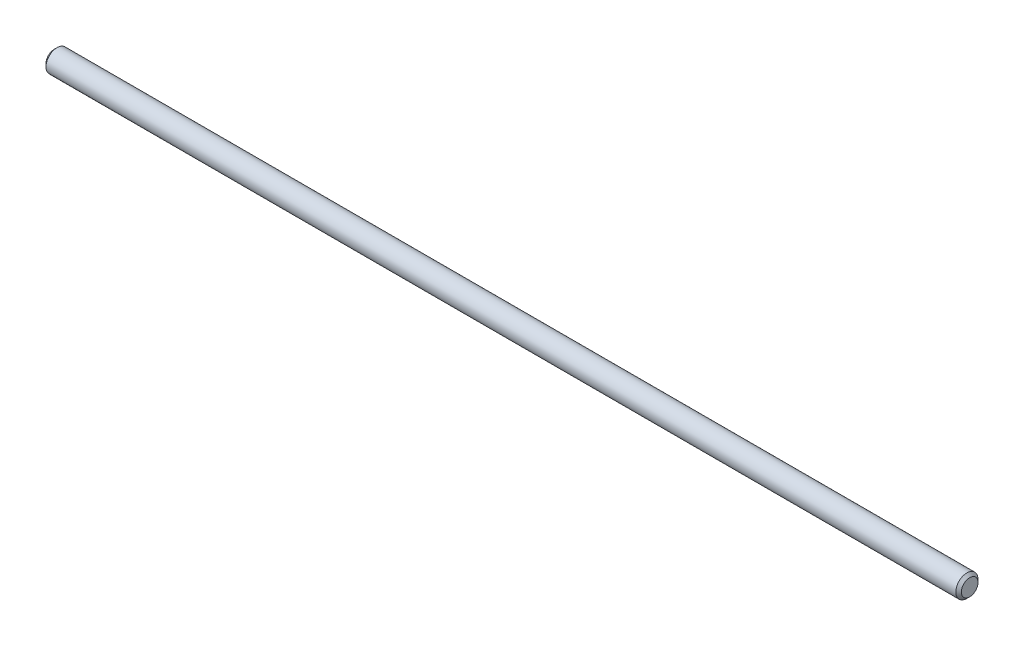
ISO-10303-21;
HEADER;
FILE_DESCRIPTION(('STEP AP214'),'2;1');
FILE_NAME('part.step','',(''),(''),'','','');
FILE_SCHEMA(('AUTOMOTIVE_DESIGN { 1 0 10303 214 1 1 1 1 }'));
ENDSEC;
DATA;
#1=APPLICATION_CONTEXT('core data for automotive mechanical design processes');
#2=APPLICATION_PROTOCOL_DEFINITION('international standard','automotive_design',2000,#1);
#3=PRODUCT_CONTEXT('',#1,'mechanical');
#4=PRODUCT('Part','Part','',(#3));
#5=PRODUCT_RELATED_PRODUCT_CATEGORY('part','',(#4));
#6=PRODUCT_DEFINITION_FORMATION('','',#4);
#7=PRODUCT_DEFINITION_CONTEXT('part definition',#1,'design');
#8=PRODUCT_DEFINITION('design','',#6,#7);
#9=PRODUCT_DEFINITION_SHAPE('','',#8);
#10=(LENGTH_UNIT() NAMED_UNIT(*) SI_UNIT(.MILLI.,.METRE.));
#11=(NAMED_UNIT(*) PLANE_ANGLE_UNIT() SI_UNIT($,.RADIAN.));
#12=(NAMED_UNIT(*) SI_UNIT($,.STERADIAN.) SOLID_ANGLE_UNIT());
#13=UNCERTAINTY_MEASURE_WITH_UNIT(LENGTH_MEASURE(1.E-05),#10,'distance_accuracy_value','');
#14=(GEOMETRIC_REPRESENTATION_CONTEXT(3) GLOBAL_UNCERTAINTY_ASSIGNED_CONTEXT((#13)) GLOBAL_UNIT_ASSIGNED_CONTEXT((#10,
#11,#12)) REPRESENTATION_CONTEXT('',''));
#15=CARTESIAN_POINT('',(0.,0.,0.));
#16=DIRECTION('',(0.,0.,1.));
#17=DIRECTION('',(1.,0.,0.));
#18=AXIS2_PLACEMENT_3D('',#15,#16,#17);
#19=CARTESIAN_POINT('',(165.,0.,0.));
#20=DIRECTION('',(-1.,0.,0.));
#21=DIRECTION('',(0.,0.,1.));
#22=AXIS2_PLACEMENT_3D('',#19,#20,#21);
#23=CYLINDRICAL_SURFACE('',#22,4.);
#24=CARTESIAN_POINT('',(-164.,0.,0.));
#25=DIRECTION('',(1.,0.,0.));
#26=DIRECTION('',(0.,0.,-1.));
#27=AXIS2_PLACEMENT_3D('',#24,#25,#26);
#28=CIRCLE('',#27,4.);
#29=CARTESIAN_POINT('',(-164.,0.,-4.));
#30=VERTEX_POINT('',#29);
#31=EDGE_CURVE('E41',#30,#30,#28,.T.);
#32=ORIENTED_EDGE('',*,*,#31,.T.);
#33=EDGE_LOOP('',(#32));
#34=FACE_BOUND('',#33,.T.);
#35=CARTESIAN_POINT('',(164.,0.,0.));
#36=DIRECTION('',(1.,0.,0.));
#37=DIRECTION('',(0.,0.,-1.));
#38=AXIS2_PLACEMENT_3D('',#35,#36,#37);
#39=CIRCLE('',#38,4.);
#40=CARTESIAN_POINT('',(164.,0.,-4.));
#41=VERTEX_POINT('',#40);
#42=EDGE_CURVE('E45',#41,#41,#39,.F.);
#43=ORIENTED_EDGE('',*,*,#42,.T.);
#44=EDGE_LOOP('',(#43));
#45=FACE_BOUND('',#44,.T.);
#46=ADVANCED_FACE('F30',(#34,#45),#23,.T.);
#47=CARTESIAN_POINT('',(165.,0.,0.));
#48=DIRECTION('',(1.,0.,0.));
#49=DIRECTION('',(0.,0.,-1.));
#50=AXIS2_PLACEMENT_3D('',#47,#48,#49);
#51=PLANE('',#50);
#52=CARTESIAN_POINT('',(165.,0.,0.));
#53=DIRECTION('',(1.,0.,0.));
#54=DIRECTION('',(0.,0.,-1.));
#55=AXIS2_PLACEMENT_3D('',#52,#53,#54);
#56=CIRCLE('',#55,3.00000000000003);
#57=CARTESIAN_POINT('',(165.,0.,-3.00000000000003));
#58=VERTEX_POINT('',#57);
#59=EDGE_CURVE('E10',#58,#58,#56,.T.);
#60=ORIENTED_EDGE('',*,*,#59,.T.);
#61=EDGE_LOOP('',(#60));
#62=FACE_BOUND('',#61,.T.);
#63=ADVANCED_FACE('F61',(#62),#51,.T.);
#64=CARTESIAN_POINT('',(-165.,0.,0.));
#65=DIRECTION('',(1.,0.,0.));
#66=DIRECTION('',(0.,0.,-1.));
#67=AXIS2_PLACEMENT_3D('',#64,#65,#66);
#68=PLANE('',#67);
#69=CARTESIAN_POINT('',(-165.,0.,0.));
#70=DIRECTION('',(1.,0.,0.));
#71=DIRECTION('',(0.,0.,-1.));
#72=AXIS2_PLACEMENT_3D('',#69,#70,#71);
#73=CIRCLE('',#72,2.99999999999995);
#74=CARTESIAN_POINT('',(-165.,0.,-2.99999999999995));
#75=VERTEX_POINT('',#74);
#76=EDGE_CURVE('E37',#75,#75,#73,.F.);
#77=ORIENTED_EDGE('',*,*,#76,.T.);
#78=EDGE_LOOP('',(#77));
#79=FACE_BOUND('',#78,.T.);
#80=ADVANCED_FACE('F58',(#79),#68,.F.);
#81=CARTESIAN_POINT('',(-164.,0.,0.));
#82=DIRECTION('',(1.,0.,0.));
#83=DIRECTION('',(0.,0.,-1.));
#84=AXIS2_PLACEMENT_3D('',#81,#82,#83);
#85=CONICAL_SURFACE('',#84,4.,0.785398163397447);
#86=ORIENTED_EDGE('',*,*,#76,.F.);
#87=EDGE_LOOP('',(#86));
#88=FACE_BOUND('',#87,.T.);
#89=ORIENTED_EDGE('',*,*,#31,.F.);
#90=EDGE_LOOP('',(#89));
#91=FACE_BOUND('',#90,.T.);
#92=ADVANCED_FACE('F54',(#88,#91),#85,.T.);
#93=CARTESIAN_POINT('',(165.,0.,0.));
#94=DIRECTION('',(-1.,0.,0.));
#95=DIRECTION('',(0.,0.,1.));
#96=AXIS2_PLACEMENT_3D('',#93,#94,#95);
#97=CONICAL_SURFACE('',#96,3.00000000000003,0.785398163397461);
#98=ORIENTED_EDGE('',*,*,#42,.F.);
#99=EDGE_LOOP('',(#98));
#100=FACE_BOUND('',#99,.T.);
#101=ORIENTED_EDGE('',*,*,#59,.F.);
#102=EDGE_LOOP('',(#101));
#103=FACE_BOUND('',#102,.T.);
#104=ADVANCED_FACE('F32',(#100,#103),#97,.T.);
#105=CLOSED_SHELL('',(#46,#63,#80,#92,#104));
#106=MANIFOLD_SOLID_BREP('B2',#105);
#107=ADVANCED_BREP_SHAPE_REPRESENTATION('',(#18,#106),#14);
#108=SHAPE_DEFINITION_REPRESENTATION(#9,#107);
ENDSEC;
END-ISO-10303-21;
